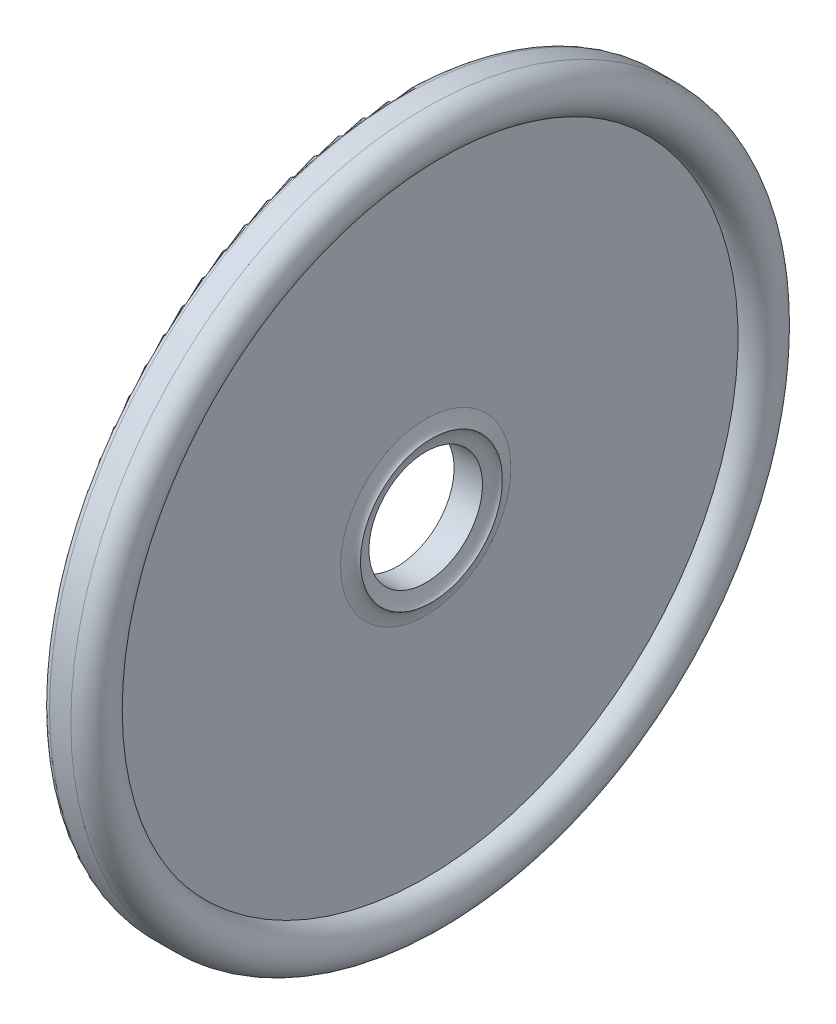
ISO-10303-21;
HEADER;
FILE_DESCRIPTION(('STEP AP214'),'2;1');
FILE_NAME('part.step','',(''),(''),'','','');
FILE_SCHEMA(('AUTOMOTIVE_DESIGN { 1 0 10303 214 1 1 1 1 }'));
ENDSEC;
DATA;
#1=APPLICATION_CONTEXT('core data for automotive mechanical design processes');
#2=APPLICATION_PROTOCOL_DEFINITION('international standard','automotive_design',2000,#1);
#3=PRODUCT_CONTEXT('',#1,'mechanical');
#4=PRODUCT('Part','Part','',(#3));
#5=PRODUCT_RELATED_PRODUCT_CATEGORY('part','',(#4));
#6=PRODUCT_DEFINITION_FORMATION('','',#4);
#7=PRODUCT_DEFINITION_CONTEXT('part definition',#1,'design');
#8=PRODUCT_DEFINITION('design','',#6,#7);
#9=PRODUCT_DEFINITION_SHAPE('','',#8);
#10=(LENGTH_UNIT() NAMED_UNIT(*) SI_UNIT(.MILLI.,.METRE.));
#11=(NAMED_UNIT(*) PLANE_ANGLE_UNIT() SI_UNIT($,.RADIAN.));
#12=(NAMED_UNIT(*) SI_UNIT($,.STERADIAN.) SOLID_ANGLE_UNIT());
#13=UNCERTAINTY_MEASURE_WITH_UNIT(LENGTH_MEASURE(1.E-05),#10,'distance_accuracy_value','');
#14=(GEOMETRIC_REPRESENTATION_CONTEXT(3) GLOBAL_UNCERTAINTY_ASSIGNED_CONTEXT((#13)) GLOBAL_UNIT_ASSIGNED_CONTEXT((#10,
#11,#12)) REPRESENTATION_CONTEXT('',''));
#15=CARTESIAN_POINT('',(0.,0.,0.));
#16=DIRECTION('',(0.,0.,1.));
#17=DIRECTION('',(1.,0.,0.));
#18=AXIS2_PLACEMENT_3D('',#15,#16,#17);
#19=CARTESIAN_POINT('',(1.,3.,0.));
#20=CARTESIAN_POINT('',(1.0782035908286,2.57566875488107,0.));
#21=CARTESIAN_POINT('',(1.2,2.5,0.));
#22=B_SPLINE_CURVE_WITH_KNOTS('',2,(#19,#20,#21),.UNSPECIFIED.,.F.,.F.,(3,3),(0.,
0.432994338417548),.UNSPECIFIED.);
#23=CARTESIAN_POINT('',(-1.44330425123842,0.,0.));
#24=DIRECTION('',(-1.,0.,0.));
#25=AXIS1_PLACEMENT('',#23,#24);
#26=SURFACE_OF_REVOLUTION('',#22,#25);
#27=CARTESIAN_POINT('',(1.2,0.,0.));
#28=DIRECTION('',(-1.,0.,0.));
#29=DIRECTION('',(0.,0.,1.));
#30=AXIS2_PLACEMENT_3D('',#27,#28,#29);
#31=CIRCLE('',#30,2.5);
#32=CARTESIAN_POINT('',(1.2,0.,2.5));
#33=VERTEX_POINT('',#32);
#34=EDGE_CURVE('E10',#33,#33,#31,.T.);
#35=ORIENTED_EDGE('',*,*,#34,.T.);
#36=EDGE_LOOP('',(#35));
#37=FACE_BOUND('',#36,.T.);
#38=CARTESIAN_POINT('',(1.,0.,0.));
#39=DIRECTION('',(-1.,0.,0.));
#40=DIRECTION('',(0.,0.,1.));
#41=AXIS2_PLACEMENT_3D('',#38,#39,#40);
#42=CIRCLE('',#41,3.);
#43=CARTESIAN_POINT('',(1.,0.,3.));
#44=VERTEX_POINT('',#43);
#45=EDGE_CURVE('E63',#44,#44,#42,.T.);
#46=ORIENTED_EDGE('',*,*,#45,.F.);
#47=EDGE_LOOP('',(#46));
#48=FACE_BOUND('',#47,.T.);
#49=ADVANCED_FACE('F34',(#37,#48),#26,.F.);
#50=CARTESIAN_POINT('',(1.2,2.5,0.));
#51=CARTESIAN_POINT('',(1.0782035908286,2.42433124511893,0.));
#52=CARTESIAN_POINT('',(1.,2.,0.));
#53=B_SPLINE_CURVE_WITH_KNOTS('',2,(#50,#51,#52),.UNSPECIFIED.,.F.,.F.,(3,3),(0.,
0.432994338417548),.UNSPECIFIED.);
#54=CARTESIAN_POINT('',(-1.44330425123842,0.,0.));
#55=DIRECTION('',(-1.,0.,0.));
#56=AXIS1_PLACEMENT('',#54,#55);
#57=SURFACE_OF_REVOLUTION('',#53,#56);
#58=CARTESIAN_POINT('',(1.,0.,0.));
#59=DIRECTION('',(-1.,0.,0.));
#60=DIRECTION('',(0.,0.,1.));
#61=AXIS2_PLACEMENT_3D('',#58,#59,#60);
#62=CIRCLE('',#61,2.);
#63=CARTESIAN_POINT('',(1.,0.,2.));
#64=VERTEX_POINT('',#63);
#65=EDGE_CURVE('E41',#64,#64,#62,.T.);
#66=ORIENTED_EDGE('',*,*,#65,.T.);
#67=EDGE_LOOP('',(#66));
#68=FACE_BOUND('',#67,.T.);
#69=ORIENTED_EDGE('',*,*,#34,.F.);
#70=EDGE_LOOP('',(#69));
#71=FACE_BOUND('',#70,.T.);
#72=ADVANCED_FACE('F75',(#68,#71),#57,.F.);
#73=CARTESIAN_POINT('',(-1.44330425123842,0.,0.));
#74=DIRECTION('',(-1.,0.,0.));
#75=DIRECTION('',(0.,0.,1.));
#76=AXIS2_PLACEMENT_3D('',#73,#74,#75);
#77=CYLINDRICAL_SURFACE('',#76,2.);
#78=CARTESIAN_POINT('',(0.,0.,0.));
#79=DIRECTION('',(-1.,0.,0.));
#80=DIRECTION('',(0.,0.,1.));
#81=AXIS2_PLACEMENT_3D('',#78,#79,#80);
#82=CIRCLE('',#81,2.);
#83=CARTESIAN_POINT('',(0.,0.,2.));
#84=VERTEX_POINT('',#83);
#85=EDGE_CURVE('E45',#84,#84,#82,.T.);
#86=ORIENTED_EDGE('',*,*,#85,.T.);
#87=EDGE_LOOP('',(#86));
#88=FACE_BOUND('',#87,.T.);
#89=ORIENTED_EDGE('',*,*,#65,.F.);
#90=EDGE_LOOP('',(#89));
#91=FACE_BOUND('',#90,.T.);
#92=ADVANCED_FACE('F78',(#88,#91),#77,.F.);
#93=CARTESIAN_POINT('',(0.,12.25,0.));
#94=DIRECTION('',(-1.,0.,0.));
#95=DIRECTION('',(0.,0.,1.));
#96=AXIS2_PLACEMENT_3D('',#93,#94,#95);
#97=PLANE('',#96);
#98=CARTESIAN_POINT('',(0.,0.,0.));
#99=DIRECTION('',(-1.,0.,0.));
#100=DIRECTION('',(0.,0.,1.));
#101=AXIS2_PLACEMENT_3D('',#98,#99,#100);
#102=CIRCLE('',#101,12.25);
#103=CARTESIAN_POINT('',(0.,0.,12.25));
#104=VERTEX_POINT('',#103);
#105=EDGE_CURVE('E49',#104,#104,#102,.T.);
#106=ORIENTED_EDGE('',*,*,#105,.T.);
#107=EDGE_LOOP('',(#106));
#108=FACE_BOUND('',#107,.T.);
#109=ORIENTED_EDGE('',*,*,#85,.F.);
#110=EDGE_LOOP('',(#109));
#111=FACE_BOUND('',#110,.T.);
#112=ADVANCED_FACE('F81',(#108,#111),#97,.T.);
#113=CARTESIAN_POINT('',(0.25,0.,0.));
#114=DIRECTION('',(-1.,0.,0.));
#115=DIRECTION('',(0.,0.,1.));
#116=AXIS2_PLACEMENT_3D('',#113,#114,#115);
#117=TOROIDAL_SURFACE('',#116,12.25,0.25);
#118=CARTESIAN_POINT('',(0.250000000000002,0.,0.));
#119=DIRECTION('',(-1.,0.,0.));
#120=DIRECTION('',(0.,0.,1.));
#121=AXIS2_PLACEMENT_3D('',#118,#119,#120);
#122=CIRCLE('',#121,12.5);
#123=CARTESIAN_POINT('',(0.250000000000002,0.,12.5));
#124=VERTEX_POINT('',#123);
#125=EDGE_CURVE('E54',#124,#124,#122,.T.);
#126=ORIENTED_EDGE('',*,*,#125,.T.);
#127=EDGE_LOOP('',(#126));
#128=FACE_BOUND('',#127,.T.);
#129=ORIENTED_EDGE('',*,*,#105,.F.);
#130=EDGE_LOOP('',(#129));
#131=FACE_BOUND('',#130,.T.);
#132=ADVANCED_FACE('F85',(#128,#131),#117,.T.);
#133=CARTESIAN_POINT('',(-1.44330425123842,0.,0.));
#134=DIRECTION('',(-1.,0.,0.));
#135=DIRECTION('',(0.,0.,1.));
#136=AXIS2_PLACEMENT_3D('',#133,#134,#135);
#137=CYLINDRICAL_SURFACE('',#136,12.5);
#138=CARTESIAN_POINT('',(1.,0.,0.));
#139=DIRECTION('',(-1.,0.,0.));
#140=DIRECTION('',(0.,0.,1.));
#141=AXIS2_PLACEMENT_3D('',#138,#139,#140);
#142=CIRCLE('',#141,12.5);
#143=CARTESIAN_POINT('',(1.,0.,12.5));
#144=VERTEX_POINT('',#143);
#145=EDGE_CURVE('E57',#144,#144,#142,.T.);
#146=ORIENTED_EDGE('',*,*,#145,.T.);
#147=EDGE_LOOP('',(#146));
#148=FACE_BOUND('',#147,.T.);
#149=ORIENTED_EDGE('',*,*,#125,.F.);
#150=EDGE_LOOP('',(#149));
#151=FACE_BOUND('',#150,.T.);
#152=ADVANCED_FACE('F89',(#148,#151),#137,.T.);
#153=CARTESIAN_POINT('',(1.,0.,0.));
#154=DIRECTION('',(-1.,0.,0.));
#155=DIRECTION('',(0.,0.,1.));
#156=AXIS2_PLACEMENT_3D('',#153,#154,#155);
#157=TOROIDAL_SURFACE('',#156,11.75,0.749999999999999);
#158=CARTESIAN_POINT('',(1.,0.,0.));
#159=DIRECTION('',(-1.,0.,0.));
#160=DIRECTION('',(0.,0.,1.));
#161=AXIS2_PLACEMENT_3D('',#158,#159,#160);
#162=CIRCLE('',#161,11.);
#163=CARTESIAN_POINT('',(1.,0.,11.));
#164=VERTEX_POINT('',#163);
#165=EDGE_CURVE('E60',#164,#164,#162,.T.);
#166=ORIENTED_EDGE('',*,*,#165,.T.);
#167=EDGE_LOOP('',(#166));
#168=FACE_BOUND('',#167,.T.);
#169=ORIENTED_EDGE('',*,*,#145,.F.);
#170=EDGE_LOOP('',(#169));
#171=FACE_BOUND('',#170,.T.);
#172=ADVANCED_FACE('F93',(#168,#171),#157,.T.);
#173=CARTESIAN_POINT('',(1.,11.,0.));
#174=DIRECTION('',(1.,0.,0.));
#175=DIRECTION('',(0.,0.,-1.));
#176=AXIS2_PLACEMENT_3D('',#173,#174,#175);
#177=PLANE('',#176);
#178=ORIENTED_EDGE('',*,*,#45,.T.);
#179=EDGE_LOOP('',(#178));
#180=FACE_BOUND('',#179,.T.);
#181=ORIENTED_EDGE('',*,*,#165,.F.);
#182=EDGE_LOOP('',(#181));
#183=FACE_BOUND('',#182,.T.);
#184=ADVANCED_FACE('F97',(#180,#183),#177,.T.);
#185=CLOSED_SHELL('',(#49,#72,#92,#112,#132,#152,#172,#184));
#186=MANIFOLD_SOLID_BREP('B2',#185);
#187=ADVANCED_BREP_SHAPE_REPRESENTATION('',(#18,#186),#14);
#188=SHAPE_DEFINITION_REPRESENTATION(#9,#187);
ENDSEC;
END-ISO-10303-21;
